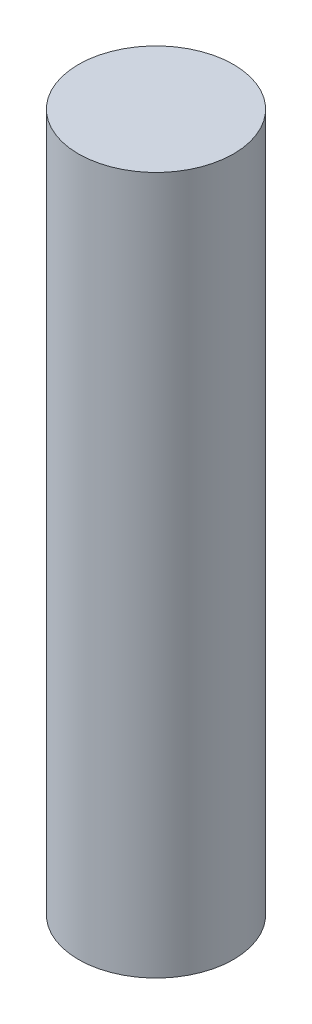
ISO-10303-21;
HEADER;
FILE_DESCRIPTION(('STEP AP214'),'2;1');
FILE_NAME('part.step','',(''),(''),'','','');
FILE_SCHEMA(('AUTOMOTIVE_DESIGN { 1 0 10303 214 1 1 1 1 }'));
ENDSEC;
DATA;
#1=APPLICATION_CONTEXT('core data for automotive mechanical design processes');
#2=APPLICATION_PROTOCOL_DEFINITION('international standard','automotive_design',2000,#1);
#3=PRODUCT_CONTEXT('',#1,'mechanical');
#4=PRODUCT('Part','Part','',(#3));
#5=PRODUCT_RELATED_PRODUCT_CATEGORY('part','',(#4));
#6=PRODUCT_DEFINITION_FORMATION('','',#4);
#7=PRODUCT_DEFINITION_CONTEXT('part definition',#1,'design');
#8=PRODUCT_DEFINITION('design','',#6,#7);
#9=PRODUCT_DEFINITION_SHAPE('','',#8);
#10=(LENGTH_UNIT() NAMED_UNIT(*) SI_UNIT(.MILLI.,.METRE.));
#11=(NAMED_UNIT(*) PLANE_ANGLE_UNIT() SI_UNIT($,.RADIAN.));
#12=(NAMED_UNIT(*) SI_UNIT($,.STERADIAN.) SOLID_ANGLE_UNIT());
#13=UNCERTAINTY_MEASURE_WITH_UNIT(LENGTH_MEASURE(1.E-05),#10,'distance_accuracy_value','');
#14=(GEOMETRIC_REPRESENTATION_CONTEXT(3) GLOBAL_UNCERTAINTY_ASSIGNED_CONTEXT((#13)) GLOBAL_UNIT_ASSIGNED_CONTEXT((#10,
#11,#12)) REPRESENTATION_CONTEXT('',''));
#15=CARTESIAN_POINT('',(0.,0.,0.));
#16=DIRECTION('',(0.,0.,1.));
#17=DIRECTION('',(1.,0.,0.));
#18=AXIS2_PLACEMENT_3D('',#15,#16,#17);
#19=CARTESIAN_POINT('',(0.,28.575,0.));
#20=DIRECTION('',(0.,-1.,0.));
#21=DIRECTION('',(0.,0.,-1.));
#22=AXIS2_PLACEMENT_3D('',#19,#20,#21);
#23=CYLINDRICAL_SURFACE('',#22,3.175);
#24=CARTESIAN_POINT('',(0.,28.575,0.));
#25=DIRECTION('',(0.,1.,0.));
#26=DIRECTION('',(0.,0.,1.));
#27=AXIS2_PLACEMENT_3D('',#24,#25,#26);
#28=CIRCLE('',#27,3.175);
#29=CARTESIAN_POINT('',(0.,28.575,3.175));
#30=VERTEX_POINT('',#29);
#31=EDGE_CURVE('E10',#30,#30,#28,.T.);
#32=ORIENTED_EDGE('',*,*,#31,.F.);
#33=EDGE_LOOP('',(#32));
#34=FACE_BOUND('',#33,.T.);
#35=CARTESIAN_POINT('',(0.,0.,0.));
#36=DIRECTION('',(0.,1.,0.));
#37=DIRECTION('',(0.,0.,1.));
#38=AXIS2_PLACEMENT_3D('',#35,#36,#37);
#39=CIRCLE('',#38,3.175);
#40=CARTESIAN_POINT('',(0.,0.,3.175));
#41=VERTEX_POINT('',#40);
#42=EDGE_CURVE('E34',#41,#41,#39,.T.);
#43=ORIENTED_EDGE('',*,*,#42,.T.);
#44=EDGE_LOOP('',(#43));
#45=FACE_BOUND('',#44,.T.);
#46=ADVANCED_FACE('F31',(#34,#45),#23,.T.);
#47=CARTESIAN_POINT('',(0.,28.575,0.));
#48=DIRECTION('',(0.,1.,0.));
#49=DIRECTION('',(0.,0.,1.));
#50=AXIS2_PLACEMENT_3D('',#47,#48,#49);
#51=PLANE('',#50);
#52=ORIENTED_EDGE('',*,*,#31,.T.);
#53=EDGE_LOOP('',(#52));
#54=FACE_BOUND('',#53,.T.);
#55=ADVANCED_FACE('F46',(#54),#51,.T.);
#56=CARTESIAN_POINT('',(0.,0.,0.));
#57=DIRECTION('',(0.,1.,0.));
#58=DIRECTION('',(0.,0.,1.));
#59=AXIS2_PLACEMENT_3D('',#56,#57,#58);
#60=PLANE('',#59);
#61=ORIENTED_EDGE('',*,*,#42,.F.);
#62=EDGE_LOOP('',(#61));
#63=FACE_BOUND('',#62,.T.);
#64=ADVANCED_FACE('F44',(#63),#60,.F.);
#65=CLOSED_SHELL('',(#46,#55,#64));
#66=MANIFOLD_SOLID_BREP('B2',#65);
#67=ADVANCED_BREP_SHAPE_REPRESENTATION('',(#18,#66),#14);
#68=SHAPE_DEFINITION_REPRESENTATION(#9,#67);
ENDSEC;
END-ISO-10303-21;
